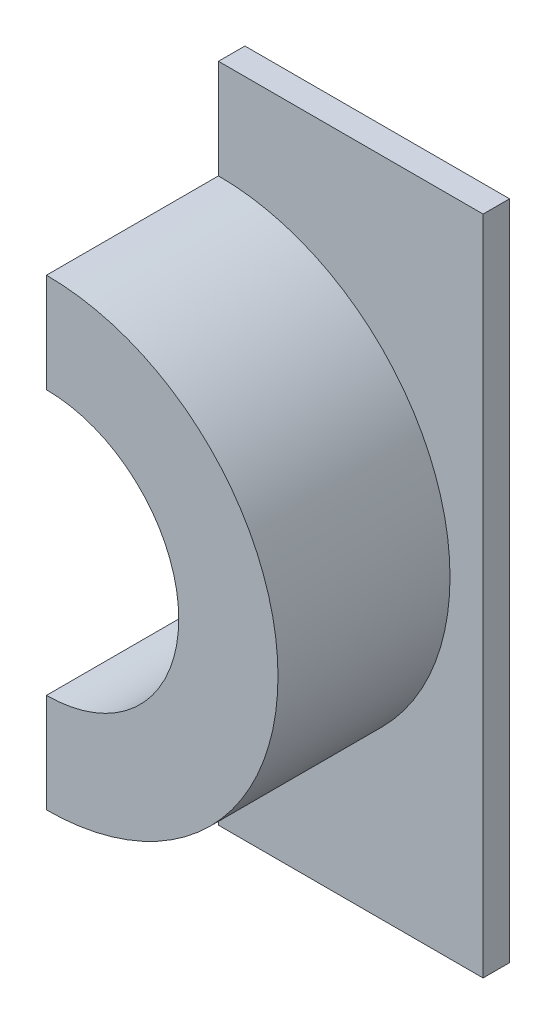
ISO-10303-21;
HEADER;
FILE_DESCRIPTION(('STEP AP214'),'2;1');
FILE_NAME('part.step','',(''),(''),'','','');
FILE_SCHEMA(('AUTOMOTIVE_DESIGN { 1 0 10303 214 1 1 1 1 }'));
ENDSEC;
DATA;
#1=APPLICATION_CONTEXT('core data for automotive mechanical design processes');
#2=APPLICATION_PROTOCOL_DEFINITION('international standard','automotive_design',2000,#1);
#3=PRODUCT_CONTEXT('',#1,'mechanical');
#4=PRODUCT('Part','Part','',(#3));
#5=PRODUCT_RELATED_PRODUCT_CATEGORY('part','',(#4));
#6=PRODUCT_DEFINITION_FORMATION('','',#4);
#7=PRODUCT_DEFINITION_CONTEXT('part definition',#1,'design');
#8=PRODUCT_DEFINITION('design','',#6,#7);
#9=PRODUCT_DEFINITION_SHAPE('','',#8);
#10=(LENGTH_UNIT() NAMED_UNIT(*) SI_UNIT(.MILLI.,.METRE.));
#11=(NAMED_UNIT(*) PLANE_ANGLE_UNIT() SI_UNIT($,.RADIAN.));
#12=(NAMED_UNIT(*) SI_UNIT($,.STERADIAN.) SOLID_ANGLE_UNIT());
#13=UNCERTAINTY_MEASURE_WITH_UNIT(LENGTH_MEASURE(1.E-05),#10,'distance_accuracy_value','');
#14=(GEOMETRIC_REPRESENTATION_CONTEXT(3) GLOBAL_UNCERTAINTY_ASSIGNED_CONTEXT((#13)) GLOBAL_UNIT_ASSIGNED_CONTEXT((#10,
#11,#12)) REPRESENTATION_CONTEXT('',''));
#15=CARTESIAN_POINT('',(0.,0.,0.));
#16=DIRECTION('',(0.,0.,1.));
#17=DIRECTION('',(1.,0.,0.));
#18=AXIS2_PLACEMENT_3D('',#15,#16,#17);
#19=CARTESIAN_POINT('',(-0.2,0.,0.04));
#20=DIRECTION('',(0.,0.,-1.));
#21=DIRECTION('',(-1.,0.,0.));
#22=AXIS2_PLACEMENT_3D('',#19,#20,#21);
#23=CYLINDRICAL_SURFACE('',#22,0.35);
#24=CARTESIAN_POINT('',(-0.2,0.,0.04));
#25=DIRECTION('',(0.,0.,-1.));
#26=DIRECTION('',(-1.,0.,0.));
#27=AXIS2_PLACEMENT_3D('',#24,#25,#26);
#28=CIRCLE('',#27,0.35);
#29=CARTESIAN_POINT('',(-0.2,0.35,0.04));
#30=VERTEX_POINT('',#29);
#31=CARTESIAN_POINT('',(-0.2,-0.35,0.04));
#32=VERTEX_POINT('',#31);
#33=EDGE_CURVE('E20',#30,#32,#28,.T.);
#34=ORIENTED_EDGE('',*,*,#33,.F.);
#35=DIRECTION('',(0.,0.,-1.));
#36=VECTOR('',#35,1.);
#37=CARTESIAN_POINT('',(-0.2,0.35,0.3));
#38=LINE('',#37,#36);
#39=CARTESIAN_POINT('',(-0.2,0.35,0.3));
#40=VERTEX_POINT('',#39);
#41=EDGE_CURVE('E117',#30,#40,#38,.F.);
#42=ORIENTED_EDGE('',*,*,#41,.T.);
#43=CARTESIAN_POINT('',(-0.2,0.,0.3));
#44=DIRECTION('',(0.,0.,-1.));
#45=DIRECTION('',(-1.,0.,0.));
#46=AXIS2_PLACEMENT_3D('',#43,#44,#45);
#47=CIRCLE('',#46,0.35);
#48=CARTESIAN_POINT('',(-0.2,-0.35,0.3));
#49=VERTEX_POINT('',#48);
#50=EDGE_CURVE('E94',#49,#40,#47,.F.);
#51=ORIENTED_EDGE('',*,*,#50,.F.);
#52=DIRECTION('',(0.,0.,-1.));
#53=VECTOR('',#52,1.);
#54=CARTESIAN_POINT('',(-0.2,-0.35,0.3));
#55=LINE('',#54,#53);
#56=EDGE_CURVE('E96',#49,#32,#55,.T.);
#57=ORIENTED_EDGE('',*,*,#56,.T.);
#58=EDGE_LOOP('',(#34,#42,#51,#57));
#59=FACE_BOUND('',#58,.T.);
#60=ADVANCED_FACE('F17',(#59),#23,.T.);
#61=CARTESIAN_POINT('',(-0.2,-0.5,0.04));
#62=DIRECTION('',(0.,0.,1.));
#63=DIRECTION('',(1.,0.,0.));
#64=AXIS2_PLACEMENT_3D('',#61,#62,#63);
#65=PLANE('',#64);
#66=DIRECTION('',(0.,1.,0.));
#67=VECTOR('',#66,1.);
#68=CARTESIAN_POINT('',(-0.2,0.35,0.04));
#69=LINE('',#68,#67);
#70=CARTESIAN_POINT('',(-0.2,-0.5,0.04));
#71=VERTEX_POINT('',#70);
#72=EDGE_CURVE('E92',#32,#71,#69,.F.);
#73=ORIENTED_EDGE('',*,*,#72,.T.);
#74=DIRECTION('',(1.,0.,0.));
#75=VECTOR('',#74,1.);
#76=CARTESIAN_POINT('',(-0.2,-0.5,0.04));
#77=LINE('',#76,#75);
#78=CARTESIAN_POINT('',(0.2,-0.5,0.04));
#79=VERTEX_POINT('',#78);
#80=EDGE_CURVE('E87',#71,#79,#77,.T.);
#81=ORIENTED_EDGE('',*,*,#80,.T.);
#82=DIRECTION('',(0.,1.,0.));
#83=VECTOR('',#82,1.);
#84=CARTESIAN_POINT('',(0.2,-0.35,0.04));
#85=LINE('',#84,#83);
#86=CARTESIAN_POINT('',(0.2,0.5,0.04));
#87=VERTEX_POINT('',#86);
#88=EDGE_CURVE('E127',#79,#87,#85,.T.);
#89=ORIENTED_EDGE('',*,*,#88,.T.);
#90=DIRECTION('',(1.,0.,0.));
#91=VECTOR('',#90,1.);
#92=CARTESIAN_POINT('',(0.2,0.5,0.04));
#93=LINE('',#92,#91);
#94=CARTESIAN_POINT('',(-0.2,0.5,0.04));
#95=VERTEX_POINT('',#94);
#96=EDGE_CURVE('E69',#87,#95,#93,.F.);
#97=ORIENTED_EDGE('',*,*,#96,.T.);
#98=DIRECTION('',(0.,1.,0.));
#99=VECTOR('',#98,1.);
#100=CARTESIAN_POINT('',(-0.2,0.35,0.04));
#101=LINE('',#100,#99);
#102=EDGE_CURVE('E93',#95,#30,#101,.F.);
#103=ORIENTED_EDGE('',*,*,#102,.T.);
#104=ORIENTED_EDGE('',*,*,#33,.T.);
#105=EDGE_LOOP('',(#73,#81,#89,#97,#103,#104));
#106=FACE_BOUND('',#105,.T.);
#107=ADVANCED_FACE('F91',(#106),#65,.T.);
#108=CARTESIAN_POINT('',(-0.2,-0.35,0.3));
#109=DIRECTION('',(0.,0.,1.));
#110=DIRECTION('',(1.,0.,0.));
#111=AXIS2_PLACEMENT_3D('',#108,#109,#110);
#112=PLANE('',#111);
#113=CARTESIAN_POINT('',(-0.2,0.,0.3));
#114=DIRECTION('',(0.,0.,1.));
#115=DIRECTION('',(1.,0.,0.));
#116=AXIS2_PLACEMENT_3D('',#113,#114,#115);
#117=CIRCLE('',#116,0.2);
#118=CARTESIAN_POINT('',(-0.2,0.2,0.3));
#119=VERTEX_POINT('',#118);
#120=CARTESIAN_POINT('',(-0.2,-0.2,0.3));
#121=VERTEX_POINT('',#120);
#122=EDGE_CURVE('E101',#119,#121,#117,.F.);
#123=ORIENTED_EDGE('',*,*,#122,.T.);
#124=DIRECTION('',(0.,1.,0.));
#125=VECTOR('',#124,1.);
#126=CARTESIAN_POINT('',(-0.2,0.35,0.3));
#127=LINE('',#126,#125);
#128=EDGE_CURVE('E107',#121,#49,#127,.F.);
#129=ORIENTED_EDGE('',*,*,#128,.T.);
#130=ORIENTED_EDGE('',*,*,#50,.T.);
#131=DIRECTION('',(0.,1.,0.));
#132=VECTOR('',#131,1.);
#133=CARTESIAN_POINT('',(-0.2,0.35,0.3));
#134=LINE('',#133,#132);
#135=EDGE_CURVE('E115',#40,#119,#134,.F.);
#136=ORIENTED_EDGE('',*,*,#135,.T.);
#137=EDGE_LOOP('',(#123,#129,#130,#136));
#138=FACE_BOUND('',#137,.T.);
#139=ADVANCED_FACE('F135',(#138),#112,.T.);
#140=CARTESIAN_POINT('',(-0.2,-0.5,0.04));
#141=DIRECTION('',(0.,1.,0.));
#142=DIRECTION('',(0.,0.,1.));
#143=AXIS2_PLACEMENT_3D('',#140,#141,#142);
#144=PLANE('',#143);
#145=DIRECTION('',(0.,0.,1.));
#146=VECTOR('',#145,1.);
#147=CARTESIAN_POINT('',(0.2,-0.5,0.3));
#148=LINE('',#147,#146);
#149=CARTESIAN_POINT('',(0.2,-0.5,0.));
#150=VERTEX_POINT('',#149);
#151=EDGE_CURVE('E110',#150,#79,#148,.T.);
#152=ORIENTED_EDGE('',*,*,#151,.T.);
#153=ORIENTED_EDGE('',*,*,#80,.F.);
#154=DIRECTION('',(0.,0.,-1.));
#155=VECTOR('',#154,1.);
#156=CARTESIAN_POINT('',(-0.2,-0.5,0.3));
#157=LINE('',#156,#155);
#158=CARTESIAN_POINT('',(-0.2,-0.5,0.));
#159=VERTEX_POINT('',#158);
#160=EDGE_CURVE('E98',#71,#159,#157,.T.);
#161=ORIENTED_EDGE('',*,*,#160,.T.);
#162=DIRECTION('',(1.,0.,0.));
#163=VECTOR('',#162,1.);
#164=CARTESIAN_POINT('',(-0.2,-0.5,0.));
#165=LINE('',#164,#163);
#166=EDGE_CURVE('E166',#159,#150,#165,.T.);
#167=ORIENTED_EDGE('',*,*,#166,.T.);
#168=EDGE_LOOP('',(#152,#153,#161,#167));
#169=FACE_BOUND('',#168,.T.);
#170=ADVANCED_FACE('F171',(#169),#144,.F.);
#171=CARTESIAN_POINT('',(0.2,-0.35,0.3));
#172=DIRECTION('',(-1.,0.,0.));
#173=DIRECTION('',(0.,0.,1.));
#174=AXIS2_PLACEMENT_3D('',#171,#172,#173);
#175=PLANE('',#174);
#176=ORIENTED_EDGE('',*,*,#88,.F.);
#177=ORIENTED_EDGE('',*,*,#151,.F.);
#178=DIRECTION('',(0.,1.,0.));
#179=VECTOR('',#178,1.);
#180=CARTESIAN_POINT('',(0.2,-0.35,0.));
#181=LINE('',#180,#179);
#182=CARTESIAN_POINT('',(0.2,0.5,0.));
#183=VERTEX_POINT('',#182);
#184=EDGE_CURVE('E157',#150,#183,#181,.T.);
#185=ORIENTED_EDGE('',*,*,#184,.T.);
#186=DIRECTION('',(0.,0.,-1.));
#187=VECTOR('',#186,1.);
#188=CARTESIAN_POINT('',(0.2,0.5,0.04));
#189=LINE('',#188,#187);
#190=EDGE_CURVE('E124',#183,#87,#189,.F.);
#191=ORIENTED_EDGE('',*,*,#190,.T.);
#192=EDGE_LOOP('',(#176,#177,#185,#191));
#193=FACE_BOUND('',#192,.T.);
#194=ADVANCED_FACE('F176',(#193),#175,.F.);
#195=CARTESIAN_POINT('',(0.2,0.5,0.04));
#196=DIRECTION('',(0.,-1.,0.));
#197=DIRECTION('',(0.,0.,-1.));
#198=AXIS2_PLACEMENT_3D('',#195,#196,#197);
#199=PLANE('',#198);
#200=DIRECTION('',(0.,0.,-1.));
#201=VECTOR('',#200,1.);
#202=CARTESIAN_POINT('',(-0.2,0.5,0.3));
#203=LINE('',#202,#201);
#204=CARTESIAN_POINT('',(-0.2,0.5,0.));
#205=VERTEX_POINT('',#204);
#206=EDGE_CURVE('E120',#205,#95,#203,.F.);
#207=ORIENTED_EDGE('',*,*,#206,.T.);
#208=ORIENTED_EDGE('',*,*,#96,.F.);
#209=ORIENTED_EDGE('',*,*,#190,.F.);
#210=DIRECTION('',(1.,0.,0.));
#211=VECTOR('',#210,1.);
#212=CARTESIAN_POINT('',(-0.2,0.5,0.));
#213=LINE('',#212,#211);
#214=EDGE_CURVE('E154',#183,#205,#213,.F.);
#215=ORIENTED_EDGE('',*,*,#214,.T.);
#216=EDGE_LOOP('',(#207,#208,#209,#215));
#217=FACE_BOUND('',#216,.T.);
#218=ADVANCED_FACE('F181',(#217),#199,.F.);
#219=CARTESIAN_POINT('',(-0.2,0.35,0.3));
#220=DIRECTION('',(1.,0.,0.));
#221=DIRECTION('',(0.,0.,-1.));
#222=AXIS2_PLACEMENT_3D('',#219,#220,#221);
#223=PLANE('',#222);
#224=DIRECTION('',(0.,0.,1.));
#225=VECTOR('',#224,1.);
#226=CARTESIAN_POINT('',(-0.2,0.2,1.204159457879));
#227=LINE('',#226,#225);
#228=CARTESIAN_POINT('',(-0.2,0.2,0.));
#229=VERTEX_POINT('',#228);
#230=EDGE_CURVE('E103',#229,#119,#227,.T.);
#231=ORIENTED_EDGE('',*,*,#230,.T.);
#232=ORIENTED_EDGE('',*,*,#135,.F.);
#233=ORIENTED_EDGE('',*,*,#41,.F.);
#234=ORIENTED_EDGE('',*,*,#102,.F.);
#235=ORIENTED_EDGE('',*,*,#206,.F.);
#236=DIRECTION('',(0.,1.,0.));
#237=VECTOR('',#236,1.);
#238=CARTESIAN_POINT('',(-0.2,-0.35,0.));
#239=LINE('',#238,#237);
#240=EDGE_CURVE('E132',#205,#229,#239,.F.);
#241=ORIENTED_EDGE('',*,*,#240,.T.);
#242=EDGE_LOOP('',(#231,#232,#233,#234,#235,#241));
#243=FACE_BOUND('',#242,.T.);
#244=ADVANCED_FACE('F139',(#243),#223,.F.);
#245=CARTESIAN_POINT('',(-0.2,0.,1.204159457879));
#246=DIRECTION('',(0.,0.,1.));
#247=DIRECTION('',(1.,0.,0.));
#248=AXIS2_PLACEMENT_3D('',#245,#246,#247);
#249=CYLINDRICAL_SURFACE('',#248,0.2);
#250=ORIENTED_EDGE('',*,*,#230,.F.);
#251=CARTESIAN_POINT('',(-0.2,0.,0.));
#252=DIRECTION('',(0.,0.,1.));
#253=DIRECTION('',(1.,0.,0.));
#254=AXIS2_PLACEMENT_3D('',#251,#252,#253);
#255=CIRCLE('',#254,0.2);
#256=CARTESIAN_POINT('',(-0.2,-0.2,0.));
#257=VERTEX_POINT('',#256);
#258=EDGE_CURVE('E26',#229,#257,#255,.F.);
#259=ORIENTED_EDGE('',*,*,#258,.T.);
#260=DIRECTION('',(0.,0.,-1.));
#261=VECTOR('',#260,1.);
#262=CARTESIAN_POINT('',(-0.2,-0.2,0.3));
#263=LINE('',#262,#261);
#264=EDGE_CURVE('E34',#257,#121,#263,.F.);
#265=ORIENTED_EDGE('',*,*,#264,.T.);
#266=ORIENTED_EDGE('',*,*,#122,.F.);
#267=EDGE_LOOP('',(#250,#259,#265,#266));
#268=FACE_BOUND('',#267,.T.);
#269=ADVANCED_FACE('F189',(#268),#249,.F.);
#270=CARTESIAN_POINT('',(-0.2,0.35,0.3));
#271=DIRECTION('',(1.,0.,0.));
#272=DIRECTION('',(0.,0.,-1.));
#273=AXIS2_PLACEMENT_3D('',#270,#271,#272);
#274=PLANE('',#273);
#275=ORIENTED_EDGE('',*,*,#264,.F.);
#276=DIRECTION('',(0.,1.,0.));
#277=VECTOR('',#276,1.);
#278=CARTESIAN_POINT('',(-0.2,-0.35,0.));
#279=LINE('',#278,#277);
#280=EDGE_CURVE('E11',#257,#159,#279,.F.);
#281=ORIENTED_EDGE('',*,*,#280,.T.);
#282=ORIENTED_EDGE('',*,*,#160,.F.);
#283=ORIENTED_EDGE('',*,*,#72,.F.);
#284=ORIENTED_EDGE('',*,*,#56,.F.);
#285=ORIENTED_EDGE('',*,*,#128,.F.);
#286=EDGE_LOOP('',(#275,#281,#282,#283,#284,#285));
#287=FACE_BOUND('',#286,.T.);
#288=ADVANCED_FACE('F95',(#287),#274,.F.);
#289=CARTESIAN_POINT('',(-0.2,-0.35,0.));
#290=DIRECTION('',(0.,0.,1.));
#291=DIRECTION('',(1.,0.,0.));
#292=AXIS2_PLACEMENT_3D('',#289,#290,#291);
#293=PLANE('',#292);
#294=ORIENTED_EDGE('',*,*,#258,.F.);
#295=ORIENTED_EDGE('',*,*,#240,.F.);
#296=ORIENTED_EDGE('',*,*,#214,.F.);
#297=ORIENTED_EDGE('',*,*,#184,.F.);
#298=ORIENTED_EDGE('',*,*,#166,.F.);
#299=ORIENTED_EDGE('',*,*,#280,.F.);
#300=EDGE_LOOP('',(#294,#295,#296,#297,#298,#299));
#301=FACE_BOUND('',#300,.T.);
#302=ADVANCED_FACE('F179',(#301),#293,.F.);
#303=CLOSED_SHELL('',(#60,#107,#139,#170,#194,#218,#244,#269,#288,#302));
#304=MANIFOLD_SOLID_BREP('B1',#303);
#305=ADVANCED_BREP_SHAPE_REPRESENTATION('',(#18,#304),#14);
#306=SHAPE_DEFINITION_REPRESENTATION(#9,#305);
ENDSEC;
END-ISO-10303-21;
